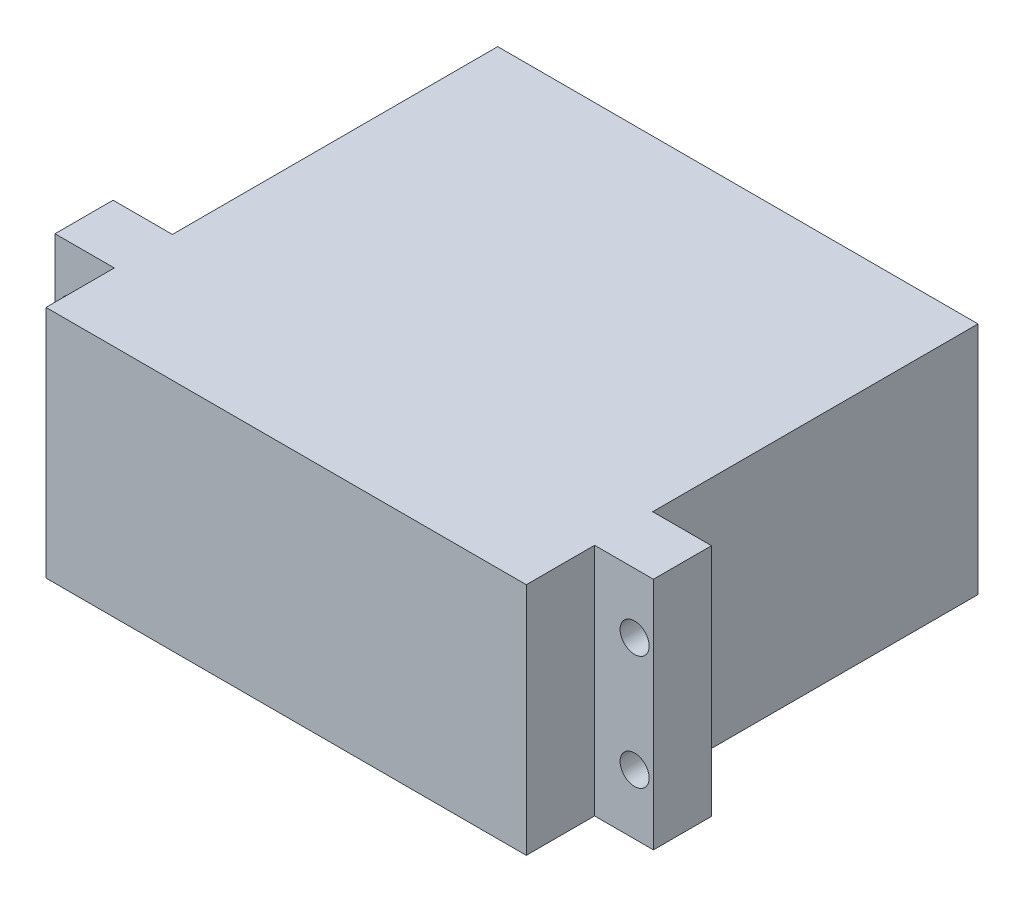
ISO-10303-21;
HEADER;
FILE_DESCRIPTION(('STEP AP214'),'2;1');
FILE_NAME('part.step','',(''),(''),'','','');
FILE_SCHEMA(('AUTOMOTIVE_DESIGN { 1 0 10303 214 1 1 1 1 }'));
ENDSEC;
DATA;
#1=APPLICATION_CONTEXT('core data for automotive mechanical design processes');
#2=APPLICATION_PROTOCOL_DEFINITION('international standard','automotive_design',2000,#1);
#3=PRODUCT_CONTEXT('',#1,'mechanical');
#4=PRODUCT('Part','Part','',(#3));
#5=PRODUCT_RELATED_PRODUCT_CATEGORY('part','',(#4));
#6=PRODUCT_DEFINITION_FORMATION('','',#4);
#7=PRODUCT_DEFINITION_CONTEXT('part definition',#1,'design');
#8=PRODUCT_DEFINITION('design','',#6,#7);
#9=PRODUCT_DEFINITION_SHAPE('','',#8);
#10=(LENGTH_UNIT() NAMED_UNIT(*) SI_UNIT(.MILLI.,.METRE.));
#11=(NAMED_UNIT(*) PLANE_ANGLE_UNIT() SI_UNIT($,.RADIAN.));
#12=(NAMED_UNIT(*) SI_UNIT($,.STERADIAN.) SOLID_ANGLE_UNIT());
#13=UNCERTAINTY_MEASURE_WITH_UNIT(LENGTH_MEASURE(1.E-05),#10,'distance_accuracy_value','');
#14=(GEOMETRIC_REPRESENTATION_CONTEXT(3) GLOBAL_UNCERTAINTY_ASSIGNED_CONTEXT((#13)) GLOBAL_UNIT_ASSIGNED_CONTEXT((#10,
#11,#12)) REPRESENTATION_CONTEXT('',''));
#15=CARTESIAN_POINT('',(0.,0.,0.));
#16=DIRECTION('',(0.,0.,1.));
#17=DIRECTION('',(1.,0.,0.));
#18=AXIS2_PLACEMENT_3D('',#15,#16,#17);
#19=CARTESIAN_POINT('',(42.,0.,39.5));
#20=DIRECTION('',(-1.,0.,0.));
#21=DIRECTION('',(0.,0.,1.));
#22=AXIS2_PLACEMENT_3D('',#19,#20,#21);
#23=PLANE('',#22);
#24=DIRECTION('',(0.,1.,0.));
#25=VECTOR('',#24,1.);
#26=CARTESIAN_POINT('',(42.,0.,28.448));
#27=LINE('',#26,#25);
#28=CARTESIAN_POINT('',(42.,0.,28.448));
#29=VERTEX_POINT('',#28);
#30=CARTESIAN_POINT('',(42.,20.5,28.448));
#31=VERTEX_POINT('',#30);
#32=EDGE_CURVE('E165',#29,#31,#27,.T.);
#33=ORIENTED_EDGE('',*,*,#32,.F.);
#34=DIRECTION('',(0.,0.,-1.));
#35=VECTOR('',#34,1.);
#36=CARTESIAN_POINT('',(42.,0.,39.5));
#37=LINE('',#36,#35);
#38=CARTESIAN_POINT('',(42.,0.,0.));
#39=VERTEX_POINT('',#38);
#40=EDGE_CURVE('E255',#29,#39,#37,.T.);
#41=ORIENTED_EDGE('',*,*,#40,.T.);
#42=DIRECTION('',(0.,1.,0.));
#43=VECTOR('',#42,1.);
#44=CARTESIAN_POINT('',(42.,0.,0.));
#45=LINE('',#44,#43);
#46=CARTESIAN_POINT('',(42.,20.5,0.));
#47=VERTEX_POINT('',#46);
#48=EDGE_CURVE('E237',#39,#47,#45,.T.);
#49=ORIENTED_EDGE('',*,*,#48,.T.);
#50=DIRECTION('',(0.,0.,-1.));
#51=VECTOR('',#50,1.);
#52=CARTESIAN_POINT('',(42.,20.5,39.5));
#53=LINE('',#52,#51);
#54=EDGE_CURVE('E248',#31,#47,#53,.T.);
#55=ORIENTED_EDGE('',*,*,#54,.F.);
#56=EDGE_LOOP('',(#33,#41,#49,#55));
#57=FACE_BOUND('',#56,.T.);
#58=ADVANCED_FACE('F34',(#57),#23,.F.);
#59=CARTESIAN_POINT('',(0.,0.,39.5));
#60=DIRECTION('',(1.,0.,0.));
#61=DIRECTION('',(0.,0.,-1.));
#62=AXIS2_PLACEMENT_3D('',#59,#60,#61);
#63=PLANE('',#62);
#64=DIRECTION('',(0.,-1.,0.));
#65=VECTOR('',#64,1.);
#66=CARTESIAN_POINT('',(0.,0.,28.448));
#67=LINE('',#66,#65);
#68=CARTESIAN_POINT('',(0.,20.5,28.448));
#69=VERTEX_POINT('',#68);
#70=CARTESIAN_POINT('',(0.,0.,28.448));
#71=VERTEX_POINT('',#70);
#72=EDGE_CURVE('E181',#69,#71,#67,.T.);
#73=ORIENTED_EDGE('',*,*,#72,.F.);
#74=DIRECTION('',(0.,0.,-1.));
#75=VECTOR('',#74,1.);
#76=CARTESIAN_POINT('',(0.,20.5,39.5));
#77=LINE('',#76,#75);
#78=CARTESIAN_POINT('',(0.,20.5,0.));
#79=VERTEX_POINT('',#78);
#80=EDGE_CURVE('E195',#69,#79,#77,.T.);
#81=ORIENTED_EDGE('',*,*,#80,.T.);
#82=DIRECTION('',(0.,-1.,0.));
#83=VECTOR('',#82,1.);
#84=CARTESIAN_POINT('',(0.,0.,0.));
#85=LINE('',#84,#83);
#86=CARTESIAN_POINT('',(0.,0.,0.));
#87=VERTEX_POINT('',#86);
#88=EDGE_CURVE('E219',#79,#87,#85,.T.);
#89=ORIENTED_EDGE('',*,*,#88,.T.);
#90=DIRECTION('',(0.,0.,-1.));
#91=VECTOR('',#90,1.);
#92=CARTESIAN_POINT('',(0.,0.,39.5));
#93=LINE('',#92,#91);
#94=EDGE_CURVE('E43',#71,#87,#93,.T.);
#95=ORIENTED_EDGE('',*,*,#94,.F.);
#96=EDGE_LOOP('',(#73,#81,#89,#95));
#97=FACE_BOUND('',#96,.T.);
#98=ADVANCED_FACE('F324',(#97),#63,.F.);
#99=CARTESIAN_POINT('',(0.,20.5,39.5));
#100=VERTEX_POINT('',#99);
#101=CARTESIAN_POINT('',(0.,20.5,33.528));
#102=VERTEX_POINT('',#101);
#103=EDGE_CURVE('E245',#100,#102,#77,.T.);
#104=ORIENTED_EDGE('',*,*,#103,.T.);
#105=DIRECTION('',(0.,-1.,0.));
#106=VECTOR('',#105,1.);
#107=CARTESIAN_POINT('',(0.,0.,33.528));
#108=LINE('',#107,#106);
#109=CARTESIAN_POINT('',(0.,0.,33.528));
#110=VERTEX_POINT('',#109);
#111=EDGE_CURVE('E191',#102,#110,#108,.T.);
#112=ORIENTED_EDGE('',*,*,#111,.T.);
#113=CARTESIAN_POINT('',(0.,0.,39.5));
#114=VERTEX_POINT('',#113);
#115=EDGE_CURVE('E11',#114,#110,#93,.T.);
#116=ORIENTED_EDGE('',*,*,#115,.F.);
#117=DIRECTION('',(0.,-1.,0.));
#118=VECTOR('',#117,1.);
#119=CARTESIAN_POINT('',(0.,0.,39.5));
#120=LINE('',#119,#118);
#121=EDGE_CURVE('E222',#100,#114,#120,.T.);
#122=ORIENTED_EDGE('',*,*,#121,.F.);
#123=EDGE_LOOP('',(#104,#112,#116,#122));
#124=FACE_BOUND('',#123,.T.);
#125=ADVANCED_FACE('F36',(#124),#63,.F.);
#126=CARTESIAN_POINT('',(0.,0.,39.5));
#127=DIRECTION('',(0.,1.,0.));
#128=DIRECTION('',(0.,0.,1.));
#129=AXIS2_PLACEMENT_3D('',#126,#127,#128);
#130=PLANE('',#129);
#131=DIRECTION('',(1.,0.,0.));
#132=VECTOR('',#131,1.);
#133=CARTESIAN_POINT('',(0.,0.,0.));
#134=LINE('',#133,#132);
#135=EDGE_CURVE('E234',#87,#39,#134,.T.);
#136=ORIENTED_EDGE('',*,*,#135,.T.);
#137=ORIENTED_EDGE('',*,*,#40,.F.);
#138=DIRECTION('',(1.,0.,0.));
#139=VECTOR('',#138,1.);
#140=CARTESIAN_POINT('',(0.,0.,28.448));
#141=LINE('',#140,#139);
#142=CARTESIAN_POINT('',(47.1446021931572,0.,28.448));
#143=VERTEX_POINT('',#142);
#144=EDGE_CURVE('E162',#29,#143,#141,.T.);
#145=ORIENTED_EDGE('',*,*,#144,.T.);
#146=DIRECTION('',(0.,0.,-1.));
#147=VECTOR('',#146,1.);
#148=CARTESIAN_POINT('',(47.1446021931572,0.,33.528));
#149=LINE('',#148,#147);
#150=CARTESIAN_POINT('',(47.1446021931572,0.,33.528));
#151=VERTEX_POINT('',#150);
#152=EDGE_CURVE('E135',#151,#143,#149,.T.);
#153=ORIENTED_EDGE('',*,*,#152,.F.);
#154=DIRECTION('',(1.,0.,0.));
#155=VECTOR('',#154,1.);
#156=CARTESIAN_POINT('',(0.,0.,33.528));
#157=LINE('',#156,#155);
#158=CARTESIAN_POINT('',(42.,0.,33.528));
#159=VERTEX_POINT('',#158);
#160=EDGE_CURVE('E139',#159,#151,#157,.T.);
#161=ORIENTED_EDGE('',*,*,#160,.F.);
#162=CARTESIAN_POINT('',(42.,0.,39.5));
#163=VERTEX_POINT('',#162);
#164=EDGE_CURVE('E250',#163,#159,#37,.T.);
#165=ORIENTED_EDGE('',*,*,#164,.F.);
#166=DIRECTION('',(1.,0.,0.));
#167=VECTOR('',#166,1.);
#168=CARTESIAN_POINT('',(0.,0.,39.5));
#169=LINE('',#168,#167);
#170=EDGE_CURVE('E225',#114,#163,#169,.T.);
#171=ORIENTED_EDGE('',*,*,#170,.F.);
#172=ORIENTED_EDGE('',*,*,#115,.T.);
#173=DIRECTION('',(1.,0.,0.));
#174=VECTOR('',#173,1.);
#175=CARTESIAN_POINT('',(0.,0.,33.528));
#176=LINE('',#175,#174);
#177=CARTESIAN_POINT('',(-5.1851184178313,0.,33.528));
#178=VERTEX_POINT('',#177);
#179=EDGE_CURVE('E59',#178,#110,#176,.T.);
#180=ORIENTED_EDGE('',*,*,#179,.F.);
#181=DIRECTION('',(0.,0.,-1.));
#182=VECTOR('',#181,1.);
#183=CARTESIAN_POINT('',(-5.1851184178313,0.,33.528));
#184=LINE('',#183,#182);
#185=CARTESIAN_POINT('',(-5.1851184178313,0.,28.448));
#186=VERTEX_POINT('',#185);
#187=EDGE_CURVE('E194',#178,#186,#184,.T.);
#188=ORIENTED_EDGE('',*,*,#187,.T.);
#189=DIRECTION('',(1.,0.,0.));
#190=VECTOR('',#189,1.);
#191=CARTESIAN_POINT('',(0.,0.,28.448));
#192=LINE('',#191,#190);
#193=EDGE_CURVE('E212',#186,#71,#192,.T.);
#194=ORIENTED_EDGE('',*,*,#193,.T.);
#195=ORIENTED_EDGE('',*,*,#94,.T.);
#196=EDGE_LOOP('',(#136,#137,#145,#153,#161,#165,#171,#172,#180,#188,#194,#195));
#197=FACE_BOUND('',#196,.T.);
#198=ADVANCED_FACE('F269',(#197),#130,.F.);
#199=ORIENTED_EDGE('',*,*,#164,.T.);
#200=DIRECTION('',(0.,1.,0.));
#201=VECTOR('',#200,1.);
#202=CARTESIAN_POINT('',(42.,0.,33.528));
#203=LINE('',#202,#201);
#204=CARTESIAN_POINT('',(42.,20.5,33.528));
#205=VERTEX_POINT('',#204);
#206=EDGE_CURVE('E136',#159,#205,#203,.T.);
#207=ORIENTED_EDGE('',*,*,#206,.T.);
#208=CARTESIAN_POINT('',(42.,20.5,39.5));
#209=VERTEX_POINT('',#208);
#210=EDGE_CURVE('E147',#209,#205,#53,.T.);
#211=ORIENTED_EDGE('',*,*,#210,.F.);
#212=DIRECTION('',(0.,1.,0.));
#213=VECTOR('',#212,1.);
#214=CARTESIAN_POINT('',(42.,0.,39.5));
#215=LINE('',#214,#213);
#216=EDGE_CURVE('E228',#163,#209,#215,.T.);
#217=ORIENTED_EDGE('',*,*,#216,.F.);
#218=EDGE_LOOP('',(#199,#207,#211,#217));
#219=FACE_BOUND('',#218,.T.);
#220=ADVANCED_FACE('F282',(#219),#23,.F.);
#221=CARTESIAN_POINT('',(0.,20.5,39.5));
#222=DIRECTION('',(0.,-1.,0.));
#223=DIRECTION('',(0.,0.,-1.));
#224=AXIS2_PLACEMENT_3D('',#221,#222,#223);
#225=PLANE('',#224);
#226=DIRECTION('',(-1.,0.,0.));
#227=VECTOR('',#226,1.);
#228=CARTESIAN_POINT('',(0.,20.5,0.));
#229=LINE('',#228,#227);
#230=EDGE_CURVE('E226',#47,#79,#229,.T.);
#231=ORIENTED_EDGE('',*,*,#230,.T.);
#232=ORIENTED_EDGE('',*,*,#80,.F.);
#233=DIRECTION('',(1.,0.,0.));
#234=VECTOR('',#233,1.);
#235=CARTESIAN_POINT('',(0.,20.5,28.448));
#236=LINE('',#235,#234);
#237=CARTESIAN_POINT('',(-5.1851184178313,20.5,28.448));
#238=VERTEX_POINT('',#237);
#239=EDGE_CURVE('E204',#238,#69,#236,.T.);
#240=ORIENTED_EDGE('',*,*,#239,.F.);
#241=DIRECTION('',(0.,0.,-1.));
#242=VECTOR('',#241,1.);
#243=CARTESIAN_POINT('',(-5.1851184178313,20.5,33.528));
#244=LINE('',#243,#242);
#245=CARTESIAN_POINT('',(-5.1851184178313,20.5,33.528));
#246=VERTEX_POINT('',#245);
#247=EDGE_CURVE('E217',#246,#238,#244,.T.);
#248=ORIENTED_EDGE('',*,*,#247,.F.);
#249=DIRECTION('',(1.,0.,0.));
#250=VECTOR('',#249,1.);
#251=CARTESIAN_POINT('',(0.,20.5,33.528));
#252=LINE('',#251,#250);
#253=EDGE_CURVE('E186',#246,#102,#252,.T.);
#254=ORIENTED_EDGE('',*,*,#253,.T.);
#255=ORIENTED_EDGE('',*,*,#103,.F.);
#256=DIRECTION('',(-1.,0.,0.));
#257=VECTOR('',#256,1.);
#258=CARTESIAN_POINT('',(0.,20.5,39.5));
#259=LINE('',#258,#257);
#260=EDGE_CURVE('E230',#209,#100,#259,.T.);
#261=ORIENTED_EDGE('',*,*,#260,.F.);
#262=ORIENTED_EDGE('',*,*,#210,.T.);
#263=DIRECTION('',(1.,0.,0.));
#264=VECTOR('',#263,1.);
#265=CARTESIAN_POINT('',(0.,20.5,33.528));
#266=LINE('',#265,#264);
#267=CARTESIAN_POINT('',(47.1446021931572,20.5,33.528));
#268=VERTEX_POINT('',#267);
#269=EDGE_CURVE('E51',#205,#268,#266,.T.);
#270=ORIENTED_EDGE('',*,*,#269,.T.);
#271=DIRECTION('',(0.,0.,-1.));
#272=VECTOR('',#271,1.);
#273=CARTESIAN_POINT('',(47.1446021931572,20.5,33.528));
#274=LINE('',#273,#272);
#275=CARTESIAN_POINT('',(47.1446021931572,20.5,28.448));
#276=VERTEX_POINT('',#275);
#277=EDGE_CURVE('E128',#268,#276,#274,.T.);
#278=ORIENTED_EDGE('',*,*,#277,.T.);
#279=DIRECTION('',(1.,0.,0.));
#280=VECTOR('',#279,1.);
#281=CARTESIAN_POINT('',(0.,20.5,28.448));
#282=LINE('',#281,#280);
#283=EDGE_CURVE('E170',#31,#276,#282,.T.);
#284=ORIENTED_EDGE('',*,*,#283,.F.);
#285=ORIENTED_EDGE('',*,*,#54,.T.);
#286=EDGE_LOOP('',(#231,#232,#240,#248,#254,#255,#261,#262,#270,#278,#284,#285));
#287=FACE_BOUND('',#286,.T.);
#288=ADVANCED_FACE('F144',(#287),#225,.F.);
#289=CARTESIAN_POINT('',(0.,0.,39.5));
#290=DIRECTION('',(0.,0.,-1.));
#291=DIRECTION('',(-1.,0.,0.));
#292=AXIS2_PLACEMENT_3D('',#289,#290,#291);
#293=PLANE('',#292);
#294=ORIENTED_EDGE('',*,*,#121,.T.);
#295=ORIENTED_EDGE('',*,*,#170,.T.);
#296=ORIENTED_EDGE('',*,*,#216,.T.);
#297=ORIENTED_EDGE('',*,*,#260,.T.);
#298=EDGE_LOOP('',(#294,#295,#296,#297));
#299=FACE_BOUND('',#298,.T.);
#300=ADVANCED_FACE('F284',(#299),#293,.F.);
#301=CARTESIAN_POINT('',(0.,0.,0.));
#302=DIRECTION('',(0.,0.,-1.));
#303=DIRECTION('',(-1.,0.,0.));
#304=AXIS2_PLACEMENT_3D('',#301,#302,#303);
#305=PLANE('',#304);
#306=ORIENTED_EDGE('',*,*,#88,.F.);
#307=ORIENTED_EDGE('',*,*,#230,.F.);
#308=ORIENTED_EDGE('',*,*,#48,.F.);
#309=ORIENTED_EDGE('',*,*,#135,.F.);
#310=EDGE_LOOP('',(#306,#307,#308,#309));
#311=FACE_BOUND('',#310,.T.);
#312=ADVANCED_FACE('F273',(#311),#305,.T.);
#313=CARTESIAN_POINT('',(-3.5,15.25,33.528));
#314=DIRECTION('',(0.,0.,-1.));
#315=DIRECTION('',(-1.,0.,0.));
#316=AXIS2_PLACEMENT_3D('',#313,#314,#315);
#317=CYLINDRICAL_SURFACE('',#316,1.27);
#318=CARTESIAN_POINT('',(-3.5,15.25,33.528));
#319=DIRECTION('',(0.,0.,-1.));
#320=DIRECTION('',(-1.,0.,0.));
#321=AXIS2_PLACEMENT_3D('',#318,#319,#320);
#322=CIRCLE('',#321,1.27);
#323=CARTESIAN_POINT('',(-4.77,15.25,33.528));
#324=VERTEX_POINT('',#323);
#325=EDGE_CURVE('E180',#324,#324,#322,.T.);
#326=ORIENTED_EDGE('',*,*,#325,.F.);
#327=EDGE_LOOP('',(#326));
#328=FACE_BOUND('',#327,.T.);
#329=CARTESIAN_POINT('',(-3.5,15.25,28.448));
#330=DIRECTION('',(0.,0.,-1.));
#331=DIRECTION('',(-1.,0.,0.));
#332=AXIS2_PLACEMENT_3D('',#329,#330,#331);
#333=CIRCLE('',#332,1.27);
#334=CARTESIAN_POINT('',(-4.77,15.25,28.448));
#335=VERTEX_POINT('',#334);
#336=EDGE_CURVE('E300',#335,#335,#333,.T.);
#337=ORIENTED_EDGE('',*,*,#336,.T.);
#338=EDGE_LOOP('',(#337));
#339=FACE_BOUND('',#338,.T.);
#340=ADVANCED_FACE('F359',(#328,#339),#317,.F.);
#341=CARTESIAN_POINT('',(-3.5,5.25,33.528));
#342=DIRECTION('',(0.,0.,-1.));
#343=DIRECTION('',(-1.,0.,0.));
#344=AXIS2_PLACEMENT_3D('',#341,#342,#343);
#345=CYLINDRICAL_SURFACE('',#344,1.27);
#346=CARTESIAN_POINT('',(-3.5,5.25,33.528));
#347=DIRECTION('',(0.,0.,-1.));
#348=DIRECTION('',(-1.,0.,0.));
#349=AXIS2_PLACEMENT_3D('',#346,#347,#348);
#350=CIRCLE('',#349,1.27);
#351=CARTESIAN_POINT('',(-4.77,5.25,33.528));
#352=VERTEX_POINT('',#351);
#353=EDGE_CURVE('E177',#352,#352,#350,.T.);
#354=ORIENTED_EDGE('',*,*,#353,.F.);
#355=EDGE_LOOP('',(#354));
#356=FACE_BOUND('',#355,.T.);
#357=CARTESIAN_POINT('',(-3.5,5.25,28.448));
#358=DIRECTION('',(0.,0.,-1.));
#359=DIRECTION('',(-1.,0.,0.));
#360=AXIS2_PLACEMENT_3D('',#357,#358,#359);
#361=CIRCLE('',#360,1.27);
#362=CARTESIAN_POINT('',(-4.77,5.25,28.448));
#363=VERTEX_POINT('',#362);
#364=EDGE_CURVE('E175',#363,#363,#361,.T.);
#365=ORIENTED_EDGE('',*,*,#364,.T.);
#366=EDGE_LOOP('',(#365));
#367=FACE_BOUND('',#366,.T.);
#368=ADVANCED_FACE('F307',(#356,#367),#345,.F.);
#369=CARTESIAN_POINT('',(-5.1851184178313,0.,33.528));
#370=DIRECTION('',(1.,0.,0.));
#371=DIRECTION('',(0.,1.,0.));
#372=AXIS2_PLACEMENT_3D('',#369,#370,#371);
#373=PLANE('',#372);
#374=DIRECTION('',(0.,-1.,0.));
#375=VECTOR('',#374,1.);
#376=CARTESIAN_POINT('',(-5.1851184178313,0.,28.448));
#377=LINE('',#376,#375);
#378=EDGE_CURVE('E206',#238,#186,#377,.T.);
#379=ORIENTED_EDGE('',*,*,#378,.T.);
#380=ORIENTED_EDGE('',*,*,#187,.F.);
#381=DIRECTION('',(0.,-1.,0.));
#382=VECTOR('',#381,1.);
#383=CARTESIAN_POINT('',(-5.1851184178313,0.,33.528));
#384=LINE('',#383,#382);
#385=EDGE_CURVE('E184',#246,#178,#384,.T.);
#386=ORIENTED_EDGE('',*,*,#385,.F.);
#387=ORIENTED_EDGE('',*,*,#247,.T.);
#388=EDGE_LOOP('',(#379,#380,#386,#387));
#389=FACE_BOUND('',#388,.T.);
#390=ADVANCED_FACE('F295',(#389),#373,.F.);
#391=CARTESIAN_POINT('',(0.,0.,33.528));
#392=DIRECTION('',(0.,0.,-1.));
#393=DIRECTION('',(-1.,0.,0.));
#394=AXIS2_PLACEMENT_3D('',#391,#392,#393);
#395=PLANE('',#394);
#396=ORIENTED_EDGE('',*,*,#353,.T.);
#397=EDGE_LOOP('',(#396));
#398=FACE_BOUND('',#397,.T.);
#399=ORIENTED_EDGE('',*,*,#325,.T.);
#400=EDGE_LOOP('',(#399));
#401=FACE_BOUND('',#400,.T.);
#402=ORIENTED_EDGE('',*,*,#179,.T.);
#403=ORIENTED_EDGE('',*,*,#111,.F.);
#404=ORIENTED_EDGE('',*,*,#253,.F.);
#405=ORIENTED_EDGE('',*,*,#385,.T.);
#406=EDGE_LOOP('',(#402,#403,#404,#405));
#407=FACE_BOUND('',#406,.T.);
#408=ADVANCED_FACE('F290',(#398,#401,#407),#395,.F.);
#409=CARTESIAN_POINT('',(0.,0.,28.448));
#410=DIRECTION('',(0.,0.,-1.));
#411=DIRECTION('',(-1.,0.,0.));
#412=AXIS2_PLACEMENT_3D('',#409,#410,#411);
#413=PLANE('',#412);
#414=ORIENTED_EDGE('',*,*,#364,.F.);
#415=EDGE_LOOP('',(#414));
#416=FACE_BOUND('',#415,.T.);
#417=ORIENTED_EDGE('',*,*,#336,.F.);
#418=EDGE_LOOP('',(#417));
#419=FACE_BOUND('',#418,.T.);
#420=ORIENTED_EDGE('',*,*,#193,.F.);
#421=ORIENTED_EDGE('',*,*,#378,.F.);
#422=ORIENTED_EDGE('',*,*,#239,.T.);
#423=ORIENTED_EDGE('',*,*,#72,.T.);
#424=EDGE_LOOP('',(#420,#421,#422,#423));
#425=FACE_BOUND('',#424,.T.);
#426=ADVANCED_FACE('F298',(#416,#419,#425),#413,.T.);
#427=CARTESIAN_POINT('',(45.5,15.25,33.528));
#428=DIRECTION('',(0.,0.,-1.));
#429=DIRECTION('',(-1.,0.,0.));
#430=AXIS2_PLACEMENT_3D('',#427,#428,#429);
#431=CYLINDRICAL_SURFACE('',#430,1.27);
#432=CARTESIAN_POINT('',(45.5,15.25,33.528));
#433=DIRECTION('',(0.,0.,-1.));
#434=DIRECTION('',(-1.,0.,0.));
#435=AXIS2_PLACEMENT_3D('',#432,#433,#434);
#436=CIRCLE('',#435,1.27);
#437=CARTESIAN_POINT('',(44.23,15.25,33.528));
#438=VERTEX_POINT('',#437);
#439=EDGE_CURVE('E148',#438,#438,#436,.T.);
#440=ORIENTED_EDGE('',*,*,#439,.F.);
#441=EDGE_LOOP('',(#440));
#442=FACE_BOUND('',#441,.T.);
#443=CARTESIAN_POINT('',(45.5,15.25,28.448));
#444=DIRECTION('',(0.,0.,-1.));
#445=DIRECTION('',(-1.,0.,0.));
#446=AXIS2_PLACEMENT_3D('',#443,#444,#445);
#447=CIRCLE('',#446,1.27);
#448=CARTESIAN_POINT('',(44.23,15.25,28.448));
#449=VERTEX_POINT('',#448);
#450=EDGE_CURVE('E277',#449,#449,#447,.T.);
#451=ORIENTED_EDGE('',*,*,#450,.T.);
#452=EDGE_LOOP('',(#451));
#453=FACE_BOUND('',#452,.T.);
#454=ADVANCED_FACE('F311',(#442,#453),#431,.F.);
#455=CARTESIAN_POINT('',(45.5,5.25,33.528));
#456=DIRECTION('',(0.,0.,-1.));
#457=DIRECTION('',(-1.,0.,0.));
#458=AXIS2_PLACEMENT_3D('',#455,#456,#457);
#459=CYLINDRICAL_SURFACE('',#458,1.27);
#460=CARTESIAN_POINT('',(45.5,5.25,33.528));
#461=DIRECTION('',(0.,0.,-1.));
#462=DIRECTION('',(-1.,0.,0.));
#463=AXIS2_PLACEMENT_3D('',#460,#461,#462);
#464=CIRCLE('',#463,1.27);
#465=CARTESIAN_POINT('',(44.23,5.25,33.528));
#466=VERTEX_POINT('',#465);
#467=EDGE_CURVE('E151',#466,#466,#464,.T.);
#468=ORIENTED_EDGE('',*,*,#467,.F.);
#469=EDGE_LOOP('',(#468));
#470=FACE_BOUND('',#469,.T.);
#471=CARTESIAN_POINT('',(45.5,5.25,28.448));
#472=DIRECTION('',(0.,0.,-1.));
#473=DIRECTION('',(-1.,0.,0.));
#474=AXIS2_PLACEMENT_3D('',#471,#472,#473);
#475=CIRCLE('',#474,1.27);
#476=CARTESIAN_POINT('',(44.23,5.25,28.448));
#477=VERTEX_POINT('',#476);
#478=EDGE_CURVE('E460',#477,#477,#475,.T.);
#479=ORIENTED_EDGE('',*,*,#478,.T.);
#480=EDGE_LOOP('',(#479));
#481=FACE_BOUND('',#480,.T.);
#482=ADVANCED_FACE('F317',(#470,#481),#459,.F.);
#483=CARTESIAN_POINT('',(47.1446021931572,0.,33.528));
#484=DIRECTION('',(1.,0.,0.));
#485=DIRECTION('',(0.,0.,-1.));
#486=AXIS2_PLACEMENT_3D('',#483,#484,#485);
#487=PLANE('',#486);
#488=DIRECTION('',(0.,-1.,0.));
#489=VECTOR('',#488,1.);
#490=CARTESIAN_POINT('',(47.1446021931572,0.,28.448));
#491=LINE('',#490,#489);
#492=EDGE_CURVE('E132',#276,#143,#491,.T.);
#493=ORIENTED_EDGE('',*,*,#492,.F.);
#494=ORIENTED_EDGE('',*,*,#277,.F.);
#495=DIRECTION('',(0.,-1.,0.));
#496=VECTOR('',#495,1.);
#497=CARTESIAN_POINT('',(47.1446021931572,0.,33.528));
#498=LINE('',#497,#496);
#499=EDGE_CURVE('E130',#268,#151,#498,.T.);
#500=ORIENTED_EDGE('',*,*,#499,.T.);
#501=ORIENTED_EDGE('',*,*,#152,.T.);
#502=EDGE_LOOP('',(#493,#494,#500,#501));
#503=FACE_BOUND('',#502,.T.);
#504=ADVANCED_FACE('F129',(#503),#487,.T.);
#505=CARTESIAN_POINT('',(0.,0.,33.528));
#506=DIRECTION('',(0.,0.,-1.));
#507=DIRECTION('',(-1.,0.,0.));
#508=AXIS2_PLACEMENT_3D('',#505,#506,#507);
#509=PLANE('',#508);
#510=ORIENTED_EDGE('',*,*,#467,.T.);
#511=EDGE_LOOP('',(#510));
#512=FACE_BOUND('',#511,.T.);
#513=ORIENTED_EDGE('',*,*,#439,.T.);
#514=EDGE_LOOP('',(#513));
#515=FACE_BOUND('',#514,.T.);
#516=ORIENTED_EDGE('',*,*,#269,.F.);
#517=ORIENTED_EDGE('',*,*,#206,.F.);
#518=ORIENTED_EDGE('',*,*,#160,.T.);
#519=ORIENTED_EDGE('',*,*,#499,.F.);
#520=EDGE_LOOP('',(#516,#517,#518,#519));
#521=FACE_BOUND('',#520,.T.);
#522=ADVANCED_FACE('F138',(#512,#515,#521),#509,.F.);
#523=CARTESIAN_POINT('',(0.,0.,28.448));
#524=DIRECTION('',(0.,0.,-1.));
#525=DIRECTION('',(-1.,0.,0.));
#526=AXIS2_PLACEMENT_3D('',#523,#524,#525);
#527=PLANE('',#526);
#528=ORIENTED_EDGE('',*,*,#478,.F.);
#529=EDGE_LOOP('',(#528));
#530=FACE_BOUND('',#529,.T.);
#531=ORIENTED_EDGE('',*,*,#450,.F.);
#532=EDGE_LOOP('',(#531));
#533=FACE_BOUND('',#532,.T.);
#534=ORIENTED_EDGE('',*,*,#283,.T.);
#535=ORIENTED_EDGE('',*,*,#492,.T.);
#536=ORIENTED_EDGE('',*,*,#144,.F.);
#537=ORIENTED_EDGE('',*,*,#32,.T.);
#538=EDGE_LOOP('',(#534,#535,#536,#537));
#539=FACE_BOUND('',#538,.T.);
#540=ADVANCED_FACE('F278',(#530,#533,#539),#527,.T.);
#541=CLOSED_SHELL('',(#58,#98,#125,#198,#220,#288,#300,#312,#340,#368,#390,#408,#426,#454,#482,
#504,#522,#540));
#542=MANIFOLD_SOLID_BREP('B2',#541);
#543=ADVANCED_BREP_SHAPE_REPRESENTATION('',(#18,#542),#14);
#544=SHAPE_DEFINITION_REPRESENTATION(#9,#543);
ENDSEC;
END-ISO-10303-21;
